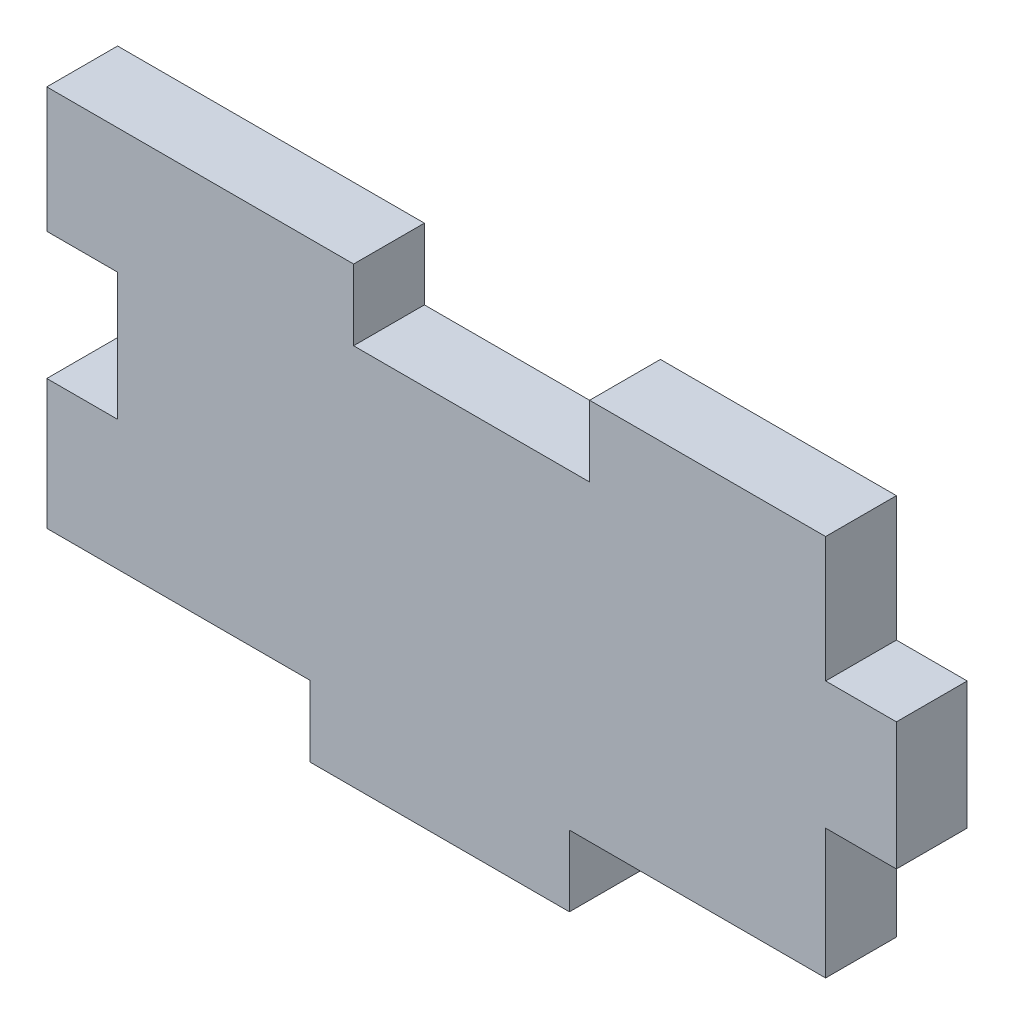
ISO-10303-21;
HEADER;
FILE_DESCRIPTION(('STEP AP214'),'2;1');
FILE_NAME('part.step','',(''),(''),'','','');
FILE_SCHEMA(('AUTOMOTIVE_DESIGN { 1 0 10303 214 1 1 1 1 }'));
ENDSEC;
DATA;
#1=APPLICATION_CONTEXT('core data for automotive mechanical design processes');
#2=APPLICATION_PROTOCOL_DEFINITION('international standard','automotive_design',2000,#1);
#3=PRODUCT_CONTEXT('',#1,'mechanical');
#4=PRODUCT('Part','Part','',(#3));
#5=PRODUCT_RELATED_PRODUCT_CATEGORY('part','',(#4));
#6=PRODUCT_DEFINITION_FORMATION('','',#4);
#7=PRODUCT_DEFINITION_CONTEXT('part definition',#1,'design');
#8=PRODUCT_DEFINITION('design','',#6,#7);
#9=PRODUCT_DEFINITION_SHAPE('','',#8);
#10=(LENGTH_UNIT() NAMED_UNIT(*) SI_UNIT(.MILLI.,.METRE.));
#11=(NAMED_UNIT(*) PLANE_ANGLE_UNIT() SI_UNIT($,.RADIAN.));
#12=(NAMED_UNIT(*) SI_UNIT($,.STERADIAN.) SOLID_ANGLE_UNIT());
#13=UNCERTAINTY_MEASURE_WITH_UNIT(LENGTH_MEASURE(1.E-05),#10,'distance_accuracy_value','');
#14=(GEOMETRIC_REPRESENTATION_CONTEXT(3) GLOBAL_UNCERTAINTY_ASSIGNED_CONTEXT((#13)) GLOBAL_UNIT_ASSIGNED_CONTEXT((#10,
#11,#12)) REPRESENTATION_CONTEXT('',''));
#15=CARTESIAN_POINT('',(0.,0.,0.));
#16=DIRECTION('',(0.,0.,1.));
#17=DIRECTION('',(1.,0.,0.));
#18=AXIS2_PLACEMENT_3D('',#15,#16,#17);
#19=CARTESIAN_POINT('',(-27.5,13.5,5.));
#20=DIRECTION('',(0.,-1.,0.));
#21=DIRECTION('',(0.,0.,-1.));
#22=AXIS2_PLACEMENT_3D('',#19,#20,#21);
#23=PLANE('',#22);
#24=DIRECTION('',(0.,0.,1.));
#25=VECTOR('',#24,1.);
#26=CARTESIAN_POINT('',(-5.83333333333332,13.5,0.));
#27=LINE('',#26,#25);
#28=CARTESIAN_POINT('',(-5.83333333333332,13.5,0.));
#29=VERTEX_POINT('',#28);
#30=CARTESIAN_POINT('',(-5.83333333333332,13.5,5.));
#31=VERTEX_POINT('',#30);
#32=EDGE_CURVE('E269',#29,#31,#27,.T.);
#33=ORIENTED_EDGE('',*,*,#32,.F.);
#34=DIRECTION('',(-1.,0.,0.));
#35=VECTOR('',#34,1.);
#36=CARTESIAN_POINT('',(-27.5,13.5,0.));
#37=LINE('',#36,#35);
#38=CARTESIAN_POINT('',(-27.5,13.5,0.));
#39=VERTEX_POINT('',#38);
#40=EDGE_CURVE('E193',#29,#39,#37,.T.);
#41=ORIENTED_EDGE('',*,*,#40,.T.);
#42=DIRECTION('',(0.,0.,-1.));
#43=VECTOR('',#42,1.);
#44=CARTESIAN_POINT('',(-27.5,13.5,5.));
#45=LINE('',#44,#43);
#46=CARTESIAN_POINT('',(-27.5,13.5,5.));
#47=VERTEX_POINT('',#46);
#48=EDGE_CURVE('E38',#47,#39,#45,.T.);
#49=ORIENTED_EDGE('',*,*,#48,.F.);
#50=DIRECTION('',(-1.,0.,0.));
#51=VECTOR('',#50,1.);
#52=CARTESIAN_POINT('',(-27.5,13.5,5.));
#53=LINE('',#52,#51);
#54=EDGE_CURVE('E119',#31,#47,#53,.T.);
#55=ORIENTED_EDGE('',*,*,#54,.F.);
#56=EDGE_LOOP('',(#33,#41,#49,#55));
#57=FACE_BOUND('',#56,.T.);
#58=ADVANCED_FACE('F31',(#57),#23,.F.);
#59=DIRECTION('',(0.,0.,-1.));
#60=VECTOR('',#59,1.);
#61=CARTESIAN_POINT('',(10.8333333333333,13.5,0.));
#62=LINE('',#61,#60);
#63=CARTESIAN_POINT('',(10.8333333333333,13.5,5.00000000000001));
#64=VERTEX_POINT('',#63);
#65=CARTESIAN_POINT('',(10.8333333333333,13.5,0.));
#66=VERTEX_POINT('',#65);
#67=EDGE_CURVE('E45',#64,#66,#62,.T.);
#68=ORIENTED_EDGE('',*,*,#67,.F.);
#69=CARTESIAN_POINT('',(27.5,13.5,5.));
#70=VERTEX_POINT('',#69);
#71=EDGE_CURVE('E321',#70,#64,#53,.T.);
#72=ORIENTED_EDGE('',*,*,#71,.F.);
#73=DIRECTION('',(0.,0.,-1.));
#74=VECTOR('',#73,1.);
#75=CARTESIAN_POINT('',(27.5,13.5,5.));
#76=LINE('',#75,#74);
#77=CARTESIAN_POINT('',(27.5,13.5,0.));
#78=VERTEX_POINT('',#77);
#79=EDGE_CURVE('E185',#70,#78,#76,.T.);
#80=ORIENTED_EDGE('',*,*,#79,.T.);
#81=EDGE_CURVE('E189',#78,#66,#37,.T.);
#82=ORIENTED_EDGE('',*,*,#81,.T.);
#83=EDGE_LOOP('',(#68,#72,#80,#82));
#84=FACE_BOUND('',#83,.T.);
#85=ADVANCED_FACE('F322',(#84),#23,.F.);
#86=CARTESIAN_POINT('',(27.5,13.5,5.));
#87=DIRECTION('',(0.,0.,1.));
#88=DIRECTION('',(1.,0.,0.));
#89=AXIS2_PLACEMENT_3D('',#86,#87,#88);
#90=PLANE('',#89);
#91=DIRECTION('',(1.,0.,0.));
#92=VECTOR('',#91,1.);
#93=CARTESIAN_POINT('',(10.8333333333333,8.49999999999999,5.00000000000001));
#94=LINE('',#93,#92);
#95=CARTESIAN_POINT('',(-5.83333333333332,8.49999999999999,5.));
#96=VERTEX_POINT('',#95);
#97=CARTESIAN_POINT('',(10.8333333333333,8.49999999999999,5.00000000000001));
#98=VERTEX_POINT('',#97);
#99=EDGE_CURVE('E337',#96,#98,#94,.T.);
#100=ORIENTED_EDGE('',*,*,#99,.F.);
#101=DIRECTION('',(0.,-1.,0.));
#102=VECTOR('',#101,1.);
#103=CARTESIAN_POINT('',(-5.83333333333332,13.5,5.));
#104=LINE('',#103,#102);
#105=EDGE_CURVE('E327',#31,#96,#104,.T.);
#106=ORIENTED_EDGE('',*,*,#105,.F.);
#107=ORIENTED_EDGE('',*,*,#54,.T.);
#108=DIRECTION('',(0.,-1.,0.));
#109=VECTOR('',#108,1.);
#110=CARTESIAN_POINT('',(-27.5,4.66666666666667,5.));
#111=LINE('',#110,#109);
#112=CARTESIAN_POINT('',(-27.5,4.66666666666667,5.));
#113=VERTEX_POINT('',#112);
#114=EDGE_CURVE('E262',#47,#113,#111,.T.);
#115=ORIENTED_EDGE('',*,*,#114,.T.);
#116=DIRECTION('',(1.,0.,0.));
#117=VECTOR('',#116,1.);
#118=CARTESIAN_POINT('',(-27.5,4.66666666666667,5.));
#119=LINE('',#118,#117);
#120=CARTESIAN_POINT('',(-22.5,4.66666666666667,5.));
#121=VERTEX_POINT('',#120);
#122=EDGE_CURVE('E288',#113,#121,#119,.T.);
#123=ORIENTED_EDGE('',*,*,#122,.T.);
#124=DIRECTION('',(0.,-1.,0.));
#125=VECTOR('',#124,1.);
#126=CARTESIAN_POINT('',(-22.5,-4.33333333333333,5.));
#127=LINE('',#126,#125);
#128=CARTESIAN_POINT('',(-22.5,-4.33333333333333,5.));
#129=VERTEX_POINT('',#128);
#130=EDGE_CURVE('E285',#121,#129,#127,.T.);
#131=ORIENTED_EDGE('',*,*,#130,.T.);
#132=DIRECTION('',(-1.,0.,0.));
#133=VECTOR('',#132,1.);
#134=CARTESIAN_POINT('',(-27.5,-4.33333333333333,5.));
#135=LINE('',#134,#133);
#136=CARTESIAN_POINT('',(-27.5,-4.33333333333333,5.));
#137=VERTEX_POINT('',#136);
#138=EDGE_CURVE('E287',#129,#137,#135,.T.);
#139=ORIENTED_EDGE('',*,*,#138,.T.);
#140=DIRECTION('',(0.,-1.,0.));
#141=VECTOR('',#140,1.);
#142=CARTESIAN_POINT('',(-27.5,-13.5,5.));
#143=LINE('',#142,#141);
#144=CARTESIAN_POINT('',(-27.5,-13.5,5.));
#145=VERTEX_POINT('',#144);
#146=EDGE_CURVE('E290',#137,#145,#143,.T.);
#147=ORIENTED_EDGE('',*,*,#146,.T.);
#148=DIRECTION('',(1.,0.,0.));
#149=VECTOR('',#148,1.);
#150=CARTESIAN_POINT('',(-27.5,-13.5,5.));
#151=LINE('',#150,#149);
#152=CARTESIAN_POINT('',(-8.92413790767913,-13.5,5.));
#153=VERTEX_POINT('',#152);
#154=EDGE_CURVE('E296',#145,#153,#151,.T.);
#155=ORIENTED_EDGE('',*,*,#154,.T.);
#156=DIRECTION('',(0.,-1.,0.));
#157=VECTOR('',#156,1.);
#158=CARTESIAN_POINT('',(-8.92413790767913,-18.5,5.));
#159=LINE('',#158,#157);
#160=CARTESIAN_POINT('',(-8.92413790767913,-18.5,5.));
#161=VERTEX_POINT('',#160);
#162=EDGE_CURVE('E298',#153,#161,#159,.T.);
#163=ORIENTED_EDGE('',*,*,#162,.T.);
#164=DIRECTION('',(1.,0.,0.));
#165=VECTOR('',#164,1.);
#166=CARTESIAN_POINT('',(-8.92413790767913,-18.5,5.));
#167=LINE('',#166,#165);
#168=CARTESIAN_POINT('',(9.40919542565419,-18.5,5.));
#169=VERTEX_POINT('',#168);
#170=EDGE_CURVE('E300',#161,#169,#167,.T.);
#171=ORIENTED_EDGE('',*,*,#170,.T.);
#172=DIRECTION('',(0.,1.,0.));
#173=VECTOR('',#172,1.);
#174=CARTESIAN_POINT('',(9.40919542565419,-18.5,5.));
#175=LINE('',#174,#173);
#176=CARTESIAN_POINT('',(9.40919542565419,-13.5,5.));
#177=VERTEX_POINT('',#176);
#178=EDGE_CURVE('E302',#169,#177,#175,.T.);
#179=ORIENTED_EDGE('',*,*,#178,.T.);
#180=DIRECTION('',(1.,0.,0.));
#181=VECTOR('',#180,1.);
#182=CARTESIAN_POINT('',(9.40919542565419,-13.5,5.));
#183=LINE('',#182,#181);
#184=CARTESIAN_POINT('',(27.5,-13.5,5.));
#185=VERTEX_POINT('',#184);
#186=EDGE_CURVE('E304',#177,#185,#183,.T.);
#187=ORIENTED_EDGE('',*,*,#186,.T.);
#188=DIRECTION('',(0.,1.,0.));
#189=VECTOR('',#188,1.);
#190=CARTESIAN_POINT('',(27.5,-13.5,5.));
#191=LINE('',#190,#189);
#192=CARTESIAN_POINT('',(27.5,-4.33333333333333,5.));
#193=VERTEX_POINT('',#192);
#194=EDGE_CURVE('E306',#185,#193,#191,.T.);
#195=ORIENTED_EDGE('',*,*,#194,.T.);
#196=DIRECTION('',(1.,0.,0.));
#197=VECTOR('',#196,1.);
#198=CARTESIAN_POINT('',(27.5,-4.33333333333333,5.));
#199=LINE('',#198,#197);
#200=CARTESIAN_POINT('',(32.5,-4.33333333333333,5.));
#201=VERTEX_POINT('',#200);
#202=EDGE_CURVE('E168',#193,#201,#199,.T.);
#203=ORIENTED_EDGE('',*,*,#202,.T.);
#204=DIRECTION('',(0.,1.,0.));
#205=VECTOR('',#204,1.);
#206=CARTESIAN_POINT('',(32.5,-4.33333333333333,5.));
#207=LINE('',#206,#205);
#208=CARTESIAN_POINT('',(32.5,4.66666666666667,5.));
#209=VERTEX_POINT('',#208);
#210=EDGE_CURVE('E160',#201,#209,#207,.T.);
#211=ORIENTED_EDGE('',*,*,#210,.T.);
#212=DIRECTION('',(-1.,0.,0.));
#213=VECTOR('',#212,1.);
#214=CARTESIAN_POINT('',(27.5,4.66666666666667,5.));
#215=LINE('',#214,#213);
#216=CARTESIAN_POINT('',(27.5,4.66666666666667,5.));
#217=VERTEX_POINT('',#216);
#218=EDGE_CURVE('E165',#209,#217,#215,.T.);
#219=ORIENTED_EDGE('',*,*,#218,.T.);
#220=DIRECTION('',(0.,1.,0.));
#221=VECTOR('',#220,1.);
#222=CARTESIAN_POINT('',(27.5,4.66666666666667,5.));
#223=LINE('',#222,#221);
#224=EDGE_CURVE('E54',#217,#70,#223,.T.);
#225=ORIENTED_EDGE('',*,*,#224,.T.);
#226=ORIENTED_EDGE('',*,*,#71,.T.);
#227=DIRECTION('',(0.,-1.,0.));
#228=VECTOR('',#227,1.);
#229=CARTESIAN_POINT('',(10.8333333333333,13.5,5.00000000000001));
#230=LINE('',#229,#228);
#231=EDGE_CURVE('E330',#64,#98,#230,.T.);
#232=ORIENTED_EDGE('',*,*,#231,.T.);
#233=EDGE_LOOP('',(#100,#106,#107,#115,#123,#131,#139,#147,#155,#163,#171,#179,#187,#195,#203,
#211,#219,#225,#226,#232));
#234=FACE_BOUND('',#233,.T.);
#235=ADVANCED_FACE('F163',(#234),#90,.T.);
#236=CARTESIAN_POINT('',(-27.5,4.66666666666667,5.));
#237=DIRECTION('',(1.,0.,0.));
#238=DIRECTION('',(0.,0.,-1.));
#239=AXIS2_PLACEMENT_3D('',#236,#237,#238);
#240=PLANE('',#239);
#241=DIRECTION('',(0.,-1.,0.));
#242=VECTOR('',#241,1.);
#243=CARTESIAN_POINT('',(-27.5,4.66666666666667,0.));
#244=LINE('',#243,#242);
#245=CARTESIAN_POINT('',(-27.5,4.66666666666667,0.));
#246=VERTEX_POINT('',#245);
#247=EDGE_CURVE('E192',#39,#246,#244,.T.);
#248=ORIENTED_EDGE('',*,*,#247,.T.);
#249=DIRECTION('',(0.,0.,-1.));
#250=VECTOR('',#249,1.);
#251=CARTESIAN_POINT('',(-27.5,4.66666666666667,5.));
#252=LINE('',#251,#250);
#253=EDGE_CURVE('E254',#113,#246,#252,.T.);
#254=ORIENTED_EDGE('',*,*,#253,.F.);
#255=ORIENTED_EDGE('',*,*,#114,.F.);
#256=ORIENTED_EDGE('',*,*,#48,.T.);
#257=EDGE_LOOP('',(#248,#254,#255,#256));
#258=FACE_BOUND('',#257,.T.);
#259=ADVANCED_FACE('F259',(#258),#240,.F.);
#260=CARTESIAN_POINT('',(-27.5,4.66666666666667,5.));
#261=DIRECTION('',(0.,1.,0.));
#262=DIRECTION('',(0.,0.,1.));
#263=AXIS2_PLACEMENT_3D('',#260,#261,#262);
#264=PLANE('',#263);
#265=DIRECTION('',(1.,0.,0.));
#266=VECTOR('',#265,1.);
#267=CARTESIAN_POINT('',(-27.5,4.66666666666667,0.));
#268=LINE('',#267,#266);
#269=CARTESIAN_POINT('',(-22.5,4.66666666666667,0.));
#270=VERTEX_POINT('',#269);
#271=EDGE_CURVE('E195',#246,#270,#268,.T.);
#272=ORIENTED_EDGE('',*,*,#271,.T.);
#273=DIRECTION('',(0.,0.,-1.));
#274=VECTOR('',#273,1.);
#275=CARTESIAN_POINT('',(-22.5,4.66666666666667,5.));
#276=LINE('',#275,#274);
#277=EDGE_CURVE('E251',#121,#270,#276,.T.);
#278=ORIENTED_EDGE('',*,*,#277,.F.);
#279=ORIENTED_EDGE('',*,*,#122,.F.);
#280=ORIENTED_EDGE('',*,*,#253,.T.);
#281=EDGE_LOOP('',(#272,#278,#279,#280));
#282=FACE_BOUND('',#281,.T.);
#283=ADVANCED_FACE('F279',(#282),#264,.F.);
#284=CARTESIAN_POINT('',(-22.5,-4.33333333333333,5.));
#285=DIRECTION('',(1.,0.,0.));
#286=DIRECTION('',(0.,0.,-1.));
#287=AXIS2_PLACEMENT_3D('',#284,#285,#286);
#288=PLANE('',#287);
#289=DIRECTION('',(0.,-1.,0.));
#290=VECTOR('',#289,1.);
#291=CARTESIAN_POINT('',(-22.5,-4.33333333333333,0.));
#292=LINE('',#291,#290);
#293=CARTESIAN_POINT('',(-22.5,-4.33333333333333,0.));
#294=VERTEX_POINT('',#293);
#295=EDGE_CURVE('E197',#270,#294,#292,.T.);
#296=ORIENTED_EDGE('',*,*,#295,.T.);
#297=DIRECTION('',(0.,0.,-1.));
#298=VECTOR('',#297,1.);
#299=CARTESIAN_POINT('',(-22.5,-4.33333333333333,5.));
#300=LINE('',#299,#298);
#301=EDGE_CURVE('E248',#129,#294,#300,.T.);
#302=ORIENTED_EDGE('',*,*,#301,.F.);
#303=ORIENTED_EDGE('',*,*,#130,.F.);
#304=ORIENTED_EDGE('',*,*,#277,.T.);
#305=EDGE_LOOP('',(#296,#302,#303,#304));
#306=FACE_BOUND('',#305,.T.);
#307=ADVANCED_FACE('F283',(#306),#288,.F.);
#308=CARTESIAN_POINT('',(-27.5,-4.33333333333333,5.));
#309=DIRECTION('',(0.,-1.,0.));
#310=DIRECTION('',(0.,0.,-1.));
#311=AXIS2_PLACEMENT_3D('',#308,#309,#310);
#312=PLANE('',#311);
#313=DIRECTION('',(-1.,0.,0.));
#314=VECTOR('',#313,1.);
#315=CARTESIAN_POINT('',(-27.5,-4.33333333333333,0.));
#316=LINE('',#315,#314);
#317=CARTESIAN_POINT('',(-27.5,-4.33333333333333,0.));
#318=VERTEX_POINT('',#317);
#319=EDGE_CURVE('E199',#294,#318,#316,.T.);
#320=ORIENTED_EDGE('',*,*,#319,.T.);
#321=DIRECTION('',(0.,0.,-1.));
#322=VECTOR('',#321,1.);
#323=CARTESIAN_POINT('',(-27.5,-4.33333333333333,5.));
#324=LINE('',#323,#322);
#325=EDGE_CURVE('E245',#137,#318,#324,.T.);
#326=ORIENTED_EDGE('',*,*,#325,.F.);
#327=ORIENTED_EDGE('',*,*,#138,.F.);
#328=ORIENTED_EDGE('',*,*,#301,.T.);
#329=EDGE_LOOP('',(#320,#326,#327,#328));
#330=FACE_BOUND('',#329,.T.);
#331=ADVANCED_FACE('F415',(#330),#312,.F.);
#332=CARTESIAN_POINT('',(-27.5,-13.5,5.));
#333=DIRECTION('',(1.,0.,0.));
#334=DIRECTION('',(0.,0.,-1.));
#335=AXIS2_PLACEMENT_3D('',#332,#333,#334);
#336=PLANE('',#335);
#337=DIRECTION('',(0.,-1.,0.));
#338=VECTOR('',#337,1.);
#339=CARTESIAN_POINT('',(-27.5,-13.5,0.));
#340=LINE('',#339,#338);
#341=CARTESIAN_POINT('',(-27.5,-13.5,0.));
#342=VERTEX_POINT('',#341);
#343=EDGE_CURVE('E201',#318,#342,#340,.T.);
#344=ORIENTED_EDGE('',*,*,#343,.T.);
#345=DIRECTION('',(0.,0.,-1.));
#346=VECTOR('',#345,1.);
#347=CARTESIAN_POINT('',(-27.5,-13.5,5.));
#348=LINE('',#347,#346);
#349=EDGE_CURVE('E242',#145,#342,#348,.T.);
#350=ORIENTED_EDGE('',*,*,#349,.F.);
#351=ORIENTED_EDGE('',*,*,#146,.F.);
#352=ORIENTED_EDGE('',*,*,#325,.T.);
#353=EDGE_LOOP('',(#344,#350,#351,#352));
#354=FACE_BOUND('',#353,.T.);
#355=ADVANCED_FACE('F411',(#354),#336,.F.);
#356=CARTESIAN_POINT('',(-27.5,-13.5,5.));
#357=DIRECTION('',(0.,1.,0.));
#358=DIRECTION('',(0.,0.,1.));
#359=AXIS2_PLACEMENT_3D('',#356,#357,#358);
#360=PLANE('',#359);
#361=DIRECTION('',(1.,0.,0.));
#362=VECTOR('',#361,1.);
#363=CARTESIAN_POINT('',(-27.5,-13.5,0.));
#364=LINE('',#363,#362);
#365=CARTESIAN_POINT('',(-8.92413790767913,-13.5,0.));
#366=VERTEX_POINT('',#365);
#367=EDGE_CURVE('E203',#342,#366,#364,.T.);
#368=ORIENTED_EDGE('',*,*,#367,.T.);
#369=DIRECTION('',(0.,0.,-1.));
#370=VECTOR('',#369,1.);
#371=CARTESIAN_POINT('',(-8.92413790767913,-13.5,5.));
#372=LINE('',#371,#370);
#373=EDGE_CURVE('E239',#153,#366,#372,.T.);
#374=ORIENTED_EDGE('',*,*,#373,.F.);
#375=ORIENTED_EDGE('',*,*,#154,.F.);
#376=ORIENTED_EDGE('',*,*,#349,.T.);
#377=EDGE_LOOP('',(#368,#374,#375,#376));
#378=FACE_BOUND('',#377,.T.);
#379=ADVANCED_FACE('F407',(#378),#360,.F.);
#380=CARTESIAN_POINT('',(-8.92413790767913,-18.5,5.));
#381=DIRECTION('',(1.,0.,0.));
#382=DIRECTION('',(0.,0.,-1.));
#383=AXIS2_PLACEMENT_3D('',#380,#381,#382);
#384=PLANE('',#383);
#385=DIRECTION('',(0.,-1.,0.));
#386=VECTOR('',#385,1.);
#387=CARTESIAN_POINT('',(-8.92413790767913,-18.5,0.));
#388=LINE('',#387,#386);
#389=CARTESIAN_POINT('',(-8.92413790767913,-18.5,0.));
#390=VERTEX_POINT('',#389);
#391=EDGE_CURVE('E205',#366,#390,#388,.T.);
#392=ORIENTED_EDGE('',*,*,#391,.T.);
#393=DIRECTION('',(0.,0.,-1.));
#394=VECTOR('',#393,1.);
#395=CARTESIAN_POINT('',(-8.92413790767913,-18.5,5.));
#396=LINE('',#395,#394);
#397=EDGE_CURVE('E236',#161,#390,#396,.T.);
#398=ORIENTED_EDGE('',*,*,#397,.F.);
#399=ORIENTED_EDGE('',*,*,#162,.F.);
#400=ORIENTED_EDGE('',*,*,#373,.T.);
#401=EDGE_LOOP('',(#392,#398,#399,#400));
#402=FACE_BOUND('',#401,.T.);
#403=ADVANCED_FACE('F403',(#402),#384,.F.);
#404=CARTESIAN_POINT('',(-8.92413790767913,-18.5,5.));
#405=DIRECTION('',(0.,1.,0.));
#406=DIRECTION('',(-1.,0.,0.));
#407=AXIS2_PLACEMENT_3D('',#404,#405,#406);
#408=PLANE('',#407);
#409=DIRECTION('',(1.,0.,0.));
#410=VECTOR('',#409,1.);
#411=CARTESIAN_POINT('',(-8.92413790767913,-18.5,0.));
#412=LINE('',#411,#410);
#413=CARTESIAN_POINT('',(9.40919542565419,-18.5,0.));
#414=VERTEX_POINT('',#413);
#415=EDGE_CURVE('E207',#390,#414,#412,.T.);
#416=ORIENTED_EDGE('',*,*,#415,.T.);
#417=DIRECTION('',(0.,0.,-1.));
#418=VECTOR('',#417,1.);
#419=CARTESIAN_POINT('',(9.40919542565419,-18.5,5.));
#420=LINE('',#419,#418);
#421=EDGE_CURVE('E233',#169,#414,#420,.T.);
#422=ORIENTED_EDGE('',*,*,#421,.F.);
#423=ORIENTED_EDGE('',*,*,#170,.F.);
#424=ORIENTED_EDGE('',*,*,#397,.T.);
#425=EDGE_LOOP('',(#416,#422,#423,#424));
#426=FACE_BOUND('',#425,.T.);
#427=ADVANCED_FACE('F399',(#426),#408,.F.);
#428=CARTESIAN_POINT('',(9.40919542565419,-18.5,5.));
#429=DIRECTION('',(-1.,0.,0.));
#430=DIRECTION('',(0.,0.,1.));
#431=AXIS2_PLACEMENT_3D('',#428,#429,#430);
#432=PLANE('',#431);
#433=DIRECTION('',(0.,1.,0.));
#434=VECTOR('',#433,1.);
#435=CARTESIAN_POINT('',(9.40919542565419,-18.5,0.));
#436=LINE('',#435,#434);
#437=CARTESIAN_POINT('',(9.40919542565419,-13.5,0.));
#438=VERTEX_POINT('',#437);
#439=EDGE_CURVE('E209',#414,#438,#436,.T.);
#440=ORIENTED_EDGE('',*,*,#439,.T.);
#441=DIRECTION('',(0.,0.,-1.));
#442=VECTOR('',#441,1.);
#443=CARTESIAN_POINT('',(9.40919542565419,-13.5,5.));
#444=LINE('',#443,#442);
#445=EDGE_CURVE('E230',#177,#438,#444,.T.);
#446=ORIENTED_EDGE('',*,*,#445,.F.);
#447=ORIENTED_EDGE('',*,*,#178,.F.);
#448=ORIENTED_EDGE('',*,*,#421,.T.);
#449=EDGE_LOOP('',(#440,#446,#447,#448));
#450=FACE_BOUND('',#449,.T.);
#451=ADVANCED_FACE('F395',(#450),#432,.F.);
#452=CARTESIAN_POINT('',(9.40919542565419,-13.5,5.));
#453=DIRECTION('',(0.,1.,0.));
#454=DIRECTION('',(0.,0.,1.));
#455=AXIS2_PLACEMENT_3D('',#452,#453,#454);
#456=PLANE('',#455);
#457=DIRECTION('',(1.,0.,0.));
#458=VECTOR('',#457,1.);
#459=CARTESIAN_POINT('',(9.40919542565419,-13.5,0.));
#460=LINE('',#459,#458);
#461=CARTESIAN_POINT('',(27.5,-13.5,0.));
#462=VERTEX_POINT('',#461);
#463=EDGE_CURVE('E211',#438,#462,#460,.T.);
#464=ORIENTED_EDGE('',*,*,#463,.T.);
#465=DIRECTION('',(0.,0.,-1.));
#466=VECTOR('',#465,1.);
#467=CARTESIAN_POINT('',(27.5,-13.5,5.));
#468=LINE('',#467,#466);
#469=EDGE_CURVE('E227',#185,#462,#468,.T.);
#470=ORIENTED_EDGE('',*,*,#469,.F.);
#471=ORIENTED_EDGE('',*,*,#186,.F.);
#472=ORIENTED_EDGE('',*,*,#445,.T.);
#473=EDGE_LOOP('',(#464,#470,#471,#472));
#474=FACE_BOUND('',#473,.T.);
#475=ADVANCED_FACE('F392',(#474),#456,.F.);
#476=CARTESIAN_POINT('',(27.5,-13.5,5.));
#477=DIRECTION('',(-1.,0.,0.));
#478=DIRECTION('',(0.,0.,1.));
#479=AXIS2_PLACEMENT_3D('',#476,#477,#478);
#480=PLANE('',#479);
#481=DIRECTION('',(0.,1.,0.));
#482=VECTOR('',#481,1.);
#483=CARTESIAN_POINT('',(27.5,-13.5,0.));
#484=LINE('',#483,#482);
#485=CARTESIAN_POINT('',(27.5,-4.33333333333333,0.));
#486=VERTEX_POINT('',#485);
#487=EDGE_CURVE('E213',#462,#486,#484,.T.);
#488=ORIENTED_EDGE('',*,*,#487,.T.);
#489=DIRECTION('',(0.,0.,-1.));
#490=VECTOR('',#489,1.);
#491=CARTESIAN_POINT('',(27.5,-4.33333333333333,5.));
#492=LINE('',#491,#490);
#493=EDGE_CURVE('E224',#193,#486,#492,.T.);
#494=ORIENTED_EDGE('',*,*,#493,.F.);
#495=ORIENTED_EDGE('',*,*,#194,.F.);
#496=ORIENTED_EDGE('',*,*,#469,.T.);
#497=EDGE_LOOP('',(#488,#494,#495,#496));
#498=FACE_BOUND('',#497,.T.);
#499=ADVANCED_FACE('F312',(#498),#480,.F.);
#500=CARTESIAN_POINT('',(27.5,-4.33333333333333,5.));
#501=DIRECTION('',(0.,1.,0.));
#502=DIRECTION('',(0.,0.,1.));
#503=AXIS2_PLACEMENT_3D('',#500,#501,#502);
#504=PLANE('',#503);
#505=DIRECTION('',(1.,0.,0.));
#506=VECTOR('',#505,1.);
#507=CARTESIAN_POINT('',(27.5,-4.33333333333333,0.));
#508=LINE('',#507,#506);
#509=CARTESIAN_POINT('',(32.5,-4.33333333333333,0.));
#510=VERTEX_POINT('',#509);
#511=EDGE_CURVE('E215',#486,#510,#508,.T.);
#512=ORIENTED_EDGE('',*,*,#511,.T.);
#513=DIRECTION('',(0.,0.,-1.));
#514=VECTOR('',#513,1.);
#515=CARTESIAN_POINT('',(32.5,-4.33333333333333,5.));
#516=LINE('',#515,#514);
#517=EDGE_CURVE('E180',#201,#510,#516,.T.);
#518=ORIENTED_EDGE('',*,*,#517,.F.);
#519=ORIENTED_EDGE('',*,*,#202,.F.);
#520=ORIENTED_EDGE('',*,*,#493,.T.);
#521=EDGE_LOOP('',(#512,#518,#519,#520));
#522=FACE_BOUND('',#521,.T.);
#523=ADVANCED_FACE('F316',(#522),#504,.F.);
#524=CARTESIAN_POINT('',(32.5,-4.33333333333333,5.));
#525=DIRECTION('',(-1.,0.,0.));
#526=DIRECTION('',(0.,0.,1.));
#527=AXIS2_PLACEMENT_3D('',#524,#525,#526);
#528=PLANE('',#527);
#529=DIRECTION('',(0.,1.,0.));
#530=VECTOR('',#529,1.);
#531=CARTESIAN_POINT('',(32.5,-4.33333333333333,0.));
#532=LINE('',#531,#530);
#533=CARTESIAN_POINT('',(32.5,4.66666666666667,0.));
#534=VERTEX_POINT('',#533);
#535=EDGE_CURVE('E177',#510,#534,#532,.T.);
#536=ORIENTED_EDGE('',*,*,#535,.T.);
#537=DIRECTION('',(0.,0.,-1.));
#538=VECTOR('',#537,1.);
#539=CARTESIAN_POINT('',(32.5,4.66666666666667,5.));
#540=LINE('',#539,#538);
#541=EDGE_CURVE('E174',#209,#534,#540,.T.);
#542=ORIENTED_EDGE('',*,*,#541,.F.);
#543=ORIENTED_EDGE('',*,*,#210,.F.);
#544=ORIENTED_EDGE('',*,*,#517,.T.);
#545=EDGE_LOOP('',(#536,#542,#543,#544));
#546=FACE_BOUND('',#545,.T.);
#547=ADVANCED_FACE('F175',(#546),#528,.F.);
#548=CARTESIAN_POINT('',(27.5,4.66666666666667,5.));
#549=DIRECTION('',(0.,-1.,0.));
#550=DIRECTION('',(0.,0.,-1.));
#551=AXIS2_PLACEMENT_3D('',#548,#549,#550);
#552=PLANE('',#551);
#553=DIRECTION('',(-1.,0.,0.));
#554=VECTOR('',#553,1.);
#555=CARTESIAN_POINT('',(27.5,4.66666666666667,0.));
#556=LINE('',#555,#554);
#557=CARTESIAN_POINT('',(27.5,4.66666666666667,0.));
#558=VERTEX_POINT('',#557);
#559=EDGE_CURVE('E218',#534,#558,#556,.T.);
#560=ORIENTED_EDGE('',*,*,#559,.T.);
#561=DIRECTION('',(0.,0.,-1.));
#562=VECTOR('',#561,1.);
#563=CARTESIAN_POINT('',(27.5,4.66666666666667,5.));
#564=LINE('',#563,#562);
#565=EDGE_CURVE('E181',#217,#558,#564,.T.);
#566=ORIENTED_EDGE('',*,*,#565,.F.);
#567=ORIENTED_EDGE('',*,*,#218,.F.);
#568=ORIENTED_EDGE('',*,*,#541,.T.);
#569=EDGE_LOOP('',(#560,#566,#567,#568));
#570=FACE_BOUND('',#569,.T.);
#571=ADVANCED_FACE('F183',(#570),#552,.F.);
#572=CARTESIAN_POINT('',(27.5,4.66666666666667,5.));
#573=DIRECTION('',(-1.,0.,0.));
#574=DIRECTION('',(0.,0.,1.));
#575=AXIS2_PLACEMENT_3D('',#572,#573,#574);
#576=PLANE('',#575);
#577=DIRECTION('',(0.,1.,0.));
#578=VECTOR('',#577,1.);
#579=CARTESIAN_POINT('',(27.5,4.66666666666667,0.));
#580=LINE('',#579,#578);
#581=EDGE_CURVE('E111',#558,#78,#580,.T.);
#582=ORIENTED_EDGE('',*,*,#581,.T.);
#583=ORIENTED_EDGE('',*,*,#79,.F.);
#584=ORIENTED_EDGE('',*,*,#224,.F.);
#585=ORIENTED_EDGE('',*,*,#565,.T.);
#586=EDGE_LOOP('',(#582,#583,#584,#585));
#587=FACE_BOUND('',#586,.T.);
#588=ADVANCED_FACE('F318',(#587),#576,.F.);
#589=CARTESIAN_POINT('',(27.5,13.5,0.));
#590=DIRECTION('',(0.,0.,1.));
#591=DIRECTION('',(1.,0.,0.));
#592=AXIS2_PLACEMENT_3D('',#589,#590,#591);
#593=PLANE('',#592);
#594=DIRECTION('',(0.,-1.,0.));
#595=VECTOR('',#594,1.);
#596=CARTESIAN_POINT('',(-5.83333333333332,13.5,0.));
#597=LINE('',#596,#595);
#598=CARTESIAN_POINT('',(-5.83333333333332,8.49999999999999,0.));
#599=VERTEX_POINT('',#598);
#600=EDGE_CURVE('E272',#29,#599,#597,.T.);
#601=ORIENTED_EDGE('',*,*,#600,.T.);
#602=DIRECTION('',(1.,0.,0.));
#603=VECTOR('',#602,1.);
#604=CARTESIAN_POINT('',(27.5,8.49999999999999,0.));
#605=LINE('',#604,#603);
#606=CARTESIAN_POINT('',(10.8333333333333,8.49999999999999,0.));
#607=VERTEX_POINT('',#606);
#608=EDGE_CURVE('E11',#599,#607,#605,.T.);
#609=ORIENTED_EDGE('',*,*,#608,.T.);
#610=DIRECTION('',(0.,-1.,0.));
#611=VECTOR('',#610,1.);
#612=CARTESIAN_POINT('',(10.8333333333333,13.5,0.));
#613=LINE('',#612,#611);
#614=EDGE_CURVE('E332',#66,#607,#613,.T.);
#615=ORIENTED_EDGE('',*,*,#614,.F.);
#616=ORIENTED_EDGE('',*,*,#81,.F.);
#617=ORIENTED_EDGE('',*,*,#581,.F.);
#618=ORIENTED_EDGE('',*,*,#559,.F.);
#619=ORIENTED_EDGE('',*,*,#535,.F.);
#620=ORIENTED_EDGE('',*,*,#511,.F.);
#621=ORIENTED_EDGE('',*,*,#487,.F.);
#622=ORIENTED_EDGE('',*,*,#463,.F.);
#623=ORIENTED_EDGE('',*,*,#439,.F.);
#624=ORIENTED_EDGE('',*,*,#415,.F.);
#625=ORIENTED_EDGE('',*,*,#391,.F.);
#626=ORIENTED_EDGE('',*,*,#367,.F.);
#627=ORIENTED_EDGE('',*,*,#343,.F.);
#628=ORIENTED_EDGE('',*,*,#319,.F.);
#629=ORIENTED_EDGE('',*,*,#295,.F.);
#630=ORIENTED_EDGE('',*,*,#271,.F.);
#631=ORIENTED_EDGE('',*,*,#247,.F.);
#632=ORIENTED_EDGE('',*,*,#40,.F.);
#633=EDGE_LOOP('',(#601,#609,#615,#616,#617,#618,#619,#620,#621,#622,#623,#624,#625,#626,#627,
#628,#629,#630,#631,#632));
#634=FACE_BOUND('',#633,.T.);
#635=ADVANCED_FACE('F274',(#634),#593,.F.);
#636=CARTESIAN_POINT('',(27.5,8.5,-50.));
#637=DIRECTION('',(0.,-1.,0.));
#638=DIRECTION('',(-1.,0.,0.));
#639=AXIS2_PLACEMENT_3D('',#636,#637,#638);
#640=PLANE('',#639);
#641=DIRECTION('',(0.,0.,1.));
#642=VECTOR('',#641,1.);
#643=CARTESIAN_POINT('',(-5.83333333333332,8.49999999999999,0.));
#644=LINE('',#643,#642);
#645=EDGE_CURVE('E340',#599,#96,#644,.T.);
#646=ORIENTED_EDGE('',*,*,#645,.T.);
#647=ORIENTED_EDGE('',*,*,#99,.T.);
#648=DIRECTION('',(0.,0.,-1.));
#649=VECTOR('',#648,1.);
#650=CARTESIAN_POINT('',(10.8333333333333,8.49999999999999,0.));
#651=LINE('',#650,#649);
#652=EDGE_CURVE('E334',#98,#607,#651,.T.);
#653=ORIENTED_EDGE('',*,*,#652,.T.);
#654=ORIENTED_EDGE('',*,*,#608,.F.);
#655=EDGE_LOOP('',(#646,#647,#653,#654));
#656=FACE_BOUND('',#655,.T.);
#657=ADVANCED_FACE('F355',(#656),#640,.F.);
#658=CARTESIAN_POINT('',(-5.83333333333332,13.5,0.));
#659=DIRECTION('',(1.,0.,0.));
#660=DIRECTION('',(0.,0.,-1.));
#661=AXIS2_PLACEMENT_3D('',#658,#659,#660);
#662=PLANE('',#661);
#663=ORIENTED_EDGE('',*,*,#645,.F.);
#664=ORIENTED_EDGE('',*,*,#600,.F.);
#665=ORIENTED_EDGE('',*,*,#32,.T.);
#666=ORIENTED_EDGE('',*,*,#105,.T.);
#667=EDGE_LOOP('',(#663,#664,#665,#666));
#668=FACE_BOUND('',#667,.T.);
#669=ADVANCED_FACE('F347',(#668),#662,.T.);
#670=CARTESIAN_POINT('',(10.8333333333333,13.5,0.));
#671=DIRECTION('',(-1.,0.,0.));
#672=DIRECTION('',(0.,0.,1.));
#673=AXIS2_PLACEMENT_3D('',#670,#671,#672);
#674=PLANE('',#673);
#675=ORIENTED_EDGE('',*,*,#652,.F.);
#676=ORIENTED_EDGE('',*,*,#231,.F.);
#677=ORIENTED_EDGE('',*,*,#67,.T.);
#678=ORIENTED_EDGE('',*,*,#614,.T.);
#679=EDGE_LOOP('',(#675,#676,#677,#678));
#680=FACE_BOUND('',#679,.T.);
#681=ADVANCED_FACE('F357',(#680),#674,.T.);
#682=CLOSED_SHELL('',(#58,#85,#235,#259,#283,#307,#331,#355,#379,#403,#427,#451,#475,#499,#523,
#547,#571,#588,#635,#657,#669,#681));
#683=MANIFOLD_SOLID_BREP('B2',#682);
#684=ADVANCED_BREP_SHAPE_REPRESENTATION('',(#18,#683),#14);
#685=SHAPE_DEFINITION_REPRESENTATION(#9,#684);
ENDSEC;
END-ISO-10303-21;
